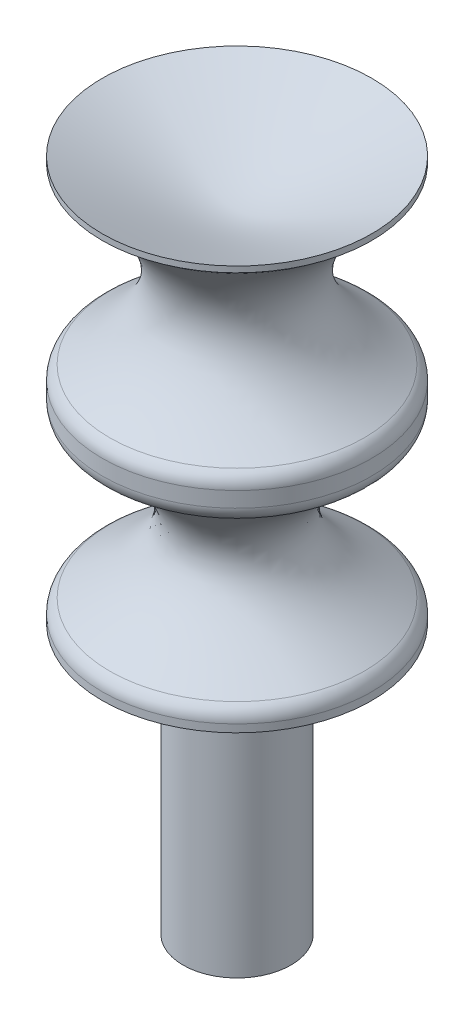
ISO-10303-21;
HEADER;
FILE_DESCRIPTION(('STEP AP214'),'2;1');
FILE_NAME('part.step','',(''),(''),'','','');
FILE_SCHEMA(('AUTOMOTIVE_DESIGN { 1 0 10303 214 1 1 1 1 }'));
ENDSEC;
DATA;
#1=APPLICATION_CONTEXT('core data for automotive mechanical design processes');
#2=APPLICATION_PROTOCOL_DEFINITION('international standard','automotive_design',2000,#1);
#3=PRODUCT_CONTEXT('',#1,'mechanical');
#4=PRODUCT('Part','Part','',(#3));
#5=PRODUCT_RELATED_PRODUCT_CATEGORY('part','',(#4));
#6=PRODUCT_DEFINITION_FORMATION('','',#4);
#7=PRODUCT_DEFINITION_CONTEXT('part definition',#1,'design');
#8=PRODUCT_DEFINITION('design','',#6,#7);
#9=PRODUCT_DEFINITION_SHAPE('','',#8);
#10=(LENGTH_UNIT() NAMED_UNIT(*) SI_UNIT(.MILLI.,.METRE.));
#11=(NAMED_UNIT(*) PLANE_ANGLE_UNIT() SI_UNIT($,.RADIAN.));
#12=(NAMED_UNIT(*) SI_UNIT($,.STERADIAN.) SOLID_ANGLE_UNIT());
#13=UNCERTAINTY_MEASURE_WITH_UNIT(LENGTH_MEASURE(1.E-05),#10,'distance_accuracy_value','');
#14=(GEOMETRIC_REPRESENTATION_CONTEXT(3) GLOBAL_UNCERTAINTY_ASSIGNED_CONTEXT((#13)) GLOBAL_UNIT_ASSIGNED_CONTEXT((#10,
#11,#12)) REPRESENTATION_CONTEXT('',''));
#15=CARTESIAN_POINT('',(0.,0.,0.));
#16=DIRECTION('',(0.,0.,1.));
#17=DIRECTION('',(1.,0.,0.));
#18=AXIS2_PLACEMENT_3D('',#15,#16,#17);
#19=CARTESIAN_POINT('',(0.,-9.525,0.));
#20=DIRECTION('',(0.,1.,0.));
#21=DIRECTION('',(0.,0.,1.));
#22=AXIS2_PLACEMENT_3D('',#19,#20,#21);
#23=CYLINDRICAL_SURFACE('',#22,6.35);
#24=CARTESIAN_POINT('',(0.,-9.16426613247415,0.));
#25=DIRECTION('',(0.,1.,0.));
#26=DIRECTION('',(0.,0.,1.));
#27=AXIS2_PLACEMENT_3D('',#24,#25,#26);
#28=CIRCLE('',#27,6.35);
#29=CARTESIAN_POINT('',(0.,-9.16426613247415,6.35));
#30=VERTEX_POINT('',#29);
#31=EDGE_CURVE('E84',#30,#30,#28,.T.);
#32=ORIENTED_EDGE('',*,*,#31,.F.);
#33=EDGE_LOOP('',(#32));
#34=FACE_BOUND('',#33,.T.);
#35=CARTESIAN_POINT('',(0.,-9.525,0.));
#36=DIRECTION('',(0.,1.,0.));
#37=DIRECTION('',(0.,0.,1.));
#38=AXIS2_PLACEMENT_3D('',#35,#36,#37);
#39=CIRCLE('',#38,6.35);
#40=CARTESIAN_POINT('',(0.,-9.525,6.35));
#41=VERTEX_POINT('',#40);
#42=EDGE_CURVE('E11',#41,#41,#39,.T.);
#43=ORIENTED_EDGE('',*,*,#42,.T.);
#44=EDGE_LOOP('',(#43));
#45=FACE_BOUND('',#44,.T.);
#46=ADVANCED_FACE('F32',(#34,#45),#23,.T.);
#47=CARTESIAN_POINT('',(0.,-9.525,-2.54));
#48=DIRECTION('',(0.,1.,0.));
#49=DIRECTION('',(0.,0.,1.));
#50=AXIS2_PLACEMENT_3D('',#47,#48,#49);
#51=PLANE('',#50);
#52=ORIENTED_EDGE('',*,*,#42,.F.);
#53=EDGE_LOOP('',(#52));
#54=FACE_BOUND('',#53,.T.);
#55=CARTESIAN_POINT('',(0.,-9.525,0.));
#56=DIRECTION('',(0.,1.,0.));
#57=DIRECTION('',(0.,0.,1.));
#58=AXIS2_PLACEMENT_3D('',#55,#56,#57);
#59=CIRCLE('',#58,2.54);
#60=CARTESIAN_POINT('',(0.,-9.525,2.54));
#61=VERTEX_POINT('',#60);
#62=EDGE_CURVE('E38',#61,#61,#59,.T.);
#63=ORIENTED_EDGE('',*,*,#62,.T.);
#64=EDGE_LOOP('',(#63));
#65=FACE_BOUND('',#64,.T.);
#66=ADVANCED_FACE('F63',(#54,#65),#51,.F.);
#67=CARTESIAN_POINT('',(0.,-9.525,0.));
#68=DIRECTION('',(0.,1.,0.));
#69=DIRECTION('',(0.,0.,1.));
#70=AXIS2_PLACEMENT_3D('',#67,#68,#69);
#71=CYLINDRICAL_SURFACE('',#70,2.54);
#72=ORIENTED_EDGE('',*,*,#62,.F.);
#73=EDGE_LOOP('',(#72));
#74=FACE_BOUND('',#73,.T.);
#75=CARTESIAN_POINT('',(0.,-22.225,0.));
#76=DIRECTION('',(0.,1.,0.));
#77=DIRECTION('',(0.,0.,1.));
#78=AXIS2_PLACEMENT_3D('',#75,#76,#77);
#79=CIRCLE('',#78,2.54);
#80=CARTESIAN_POINT('',(0.,-22.225,2.54));
#81=VERTEX_POINT('',#80);
#82=EDGE_CURVE('E51',#81,#81,#79,.T.);
#83=ORIENTED_EDGE('',*,*,#82,.T.);
#84=EDGE_LOOP('',(#83));
#85=FACE_BOUND('',#84,.T.);
#86=ADVANCED_FACE('F65',(#74,#85),#71,.T.);
#87=CARTESIAN_POINT('',(0.,-22.225,0.));
#88=DIRECTION('',(0.,1.,0.));
#89=DIRECTION('',(0.,0.,1.));
#90=AXIS2_PLACEMENT_3D('',#87,#88,#89);
#91=PLANE('',#90);
#92=ORIENTED_EDGE('',*,*,#82,.F.);
#93=EDGE_LOOP('',(#92));
#94=FACE_BOUND('',#93,.T.);
#95=ADVANCED_FACE('F45',(#94),#91,.F.);
#96=CARTESIAN_POINT('',(0.,9.52499999999999,-6.34999999999999));
#97=CARTESIAN_POINT('',(0.,7.39028757477112,-1.5875));
#98=CARTESIAN_POINT('',(0.,7.39028757477112,0.));
#99=(BOUNDED_CURVE() B_SPLINE_CURVE(2,(#96,#97,#98),.UNSPECIFIED.,.F.,
.F.) B_SPLINE_CURVE_WITH_KNOTS((3,3),(0.,1.),
.UNSPECIFIED.) CURVE() GEOMETRIC_REPRESENTATION_ITEM() RATIONAL_B_SPLINE_CURVE((1.,
1.4142135623731,1.)) REPRESENTATION_ITEM(''));
#100=CARTESIAN_POINT('',(0.,-9.525,0.));
#101=DIRECTION('',(0.,1.,0.));
#102=AXIS1_PLACEMENT('',#100,#101);
#103=SURFACE_OF_REVOLUTION('',#99,#102);
#104=CARTESIAN_POINT('',(0.,7.39028757477112,0.));
#105=VERTEX_POINT('',#104);
#106=VERTEX_LOOP('',#105);
#107=FACE_BOUND('',#106,.T.);
#108=CARTESIAN_POINT('',(0.,9.52499999999999,0.));
#109=DIRECTION('',(0.,1.,0.));
#110=DIRECTION('',(0.,0.,1.));
#111=AXIS2_PLACEMENT_3D('',#108,#109,#110);
#112=CIRCLE('',#111,6.35);
#113=CARTESIAN_POINT('',(0.,9.52499999999999,6.35));
#114=VERTEX_POINT('',#113);
#115=EDGE_CURVE('E49',#114,#114,#112,.T.);
#116=ORIENTED_EDGE('',*,*,#115,.T.);
#117=EDGE_LOOP('',(#116));
#118=FACE_BOUND('',#117,.T.);
#119=ADVANCED_FACE('F41',(#107,#118),#103,.T.);
#120=CARTESIAN_POINT('',(0.,-9.525,0.));
#121=DIRECTION('',(0.,1.,0.));
#122=DIRECTION('',(0.,0.,1.));
#123=AXIS2_PLACEMENT_3D('',#120,#121,#122);
#124=CYLINDRICAL_SURFACE('',#123,6.35);
#125=ORIENTED_EDGE('',*,*,#115,.F.);
#126=EDGE_LOOP('',(#125));
#127=FACE_BOUND('',#126,.T.);
#128=CARTESIAN_POINT('',(0.,9.2470516974163,0.));
#129=DIRECTION('',(0.,1.,0.));
#130=DIRECTION('',(0.,0.,1.));
#131=AXIS2_PLACEMENT_3D('',#128,#129,#130);
#132=CIRCLE('',#131,6.35);
#133=CARTESIAN_POINT('',(0.,9.2470516974163,6.35));
#134=VERTEX_POINT('',#133);
#135=EDGE_CURVE('E52',#134,#134,#132,.T.);
#136=ORIENTED_EDGE('',*,*,#135,.T.);
#137=EDGE_LOOP('',(#136));
#138=FACE_BOUND('',#137,.T.);
#139=ADVANCED_FACE('F44',(#127,#138),#124,.T.);
#140=CARTESIAN_POINT('',(0.,1.0219473740694,-5.99602155439972));
#141=CARTESIAN_POINT('',(0.,4.8911876439237,-0.18221811098451));
#142=CARTESIAN_POINT('',(0.,9.2470516974163,-6.34999999999999));
#143=B_SPLINE_CURVE_WITH_KNOTS('',2,(#140,#141,#142),.UNSPECIFIED.,.F.,.F.,(3,3),(0.,1.),.UNSPECIFIED.);
#144=CARTESIAN_POINT('',(0.,-9.525,0.));
#145=DIRECTION('',(0.,1.,0.));
#146=AXIS1_PLACEMENT('',#144,#145);
#147=SURFACE_OF_REVOLUTION('',#143,#146);
#148=ORIENTED_EDGE('',*,*,#135,.F.);
#149=EDGE_LOOP('',(#148));
#150=FACE_BOUND('',#149,.T.);
#151=CARTESIAN_POINT('',(0.,1.0219473740694,0.));
#152=DIRECTION('',(0.,1.,0.));
#153=DIRECTION('',(0.,0.,1.));
#154=AXIS2_PLACEMENT_3D('',#151,#152,#153);
#155=CIRCLE('',#154,5.99602155439972);
#156=CARTESIAN_POINT('',(0.,1.02194737406939,5.99602155439972));
#157=VERTEX_POINT('',#156);
#158=EDGE_CURVE('E57',#157,#157,#155,.T.);
#159=ORIENTED_EDGE('',*,*,#158,.T.);
#160=EDGE_LOOP('',(#159));
#161=FACE_BOUND('',#160,.T.);
#162=ADVANCED_FACE('F108',(#150,#161),#147,.T.);
#163=CARTESIAN_POINT('',(0.,0.361159932874533,0.));
#164=DIRECTION('',(0.,1.,0.));
#165=DIRECTION('',(0.,0.,1.));
#166=AXIS2_PLACEMENT_3D('',#163,#164,#165);
#167=TOROIDAL_SURFACE('',#166,5.55625,0.79375);
#168=ORIENTED_EDGE('',*,*,#158,.F.);
#169=EDGE_LOOP('',(#168));
#170=FACE_BOUND('',#169,.T.);
#171=CARTESIAN_POINT('',(0.,0.361159932874533,0.));
#172=DIRECTION('',(0.,1.,0.));
#173=DIRECTION('',(0.,0.,1.));
#174=AXIS2_PLACEMENT_3D('',#171,#172,#173);
#175=CIRCLE('',#174,6.35);
#176=CARTESIAN_POINT('',(0.,0.361159932874532,6.35));
#177=VERTEX_POINT('',#176);
#178=EDGE_CURVE('E103',#177,#177,#175,.T.);
#179=ORIENTED_EDGE('',*,*,#178,.T.);
#180=EDGE_LOOP('',(#179));
#181=FACE_BOUND('',#180,.T.);
#182=ADVANCED_FACE('F110',(#170,#181),#167,.T.);
#183=CARTESIAN_POINT('',(0.,-9.525,0.));
#184=DIRECTION('',(0.,1.,0.));
#185=DIRECTION('',(0.,0.,1.));
#186=AXIS2_PLACEMENT_3D('',#183,#184,#185);
#187=CYLINDRICAL_SURFACE('',#186,6.35);
#188=ORIENTED_EDGE('',*,*,#178,.F.);
#189=EDGE_LOOP('',(#188));
#190=FACE_BOUND('',#189,.T.);
#191=CARTESIAN_POINT('',(0.,-0.36073386752585,0.));
#192=DIRECTION('',(0.,1.,0.));
#193=DIRECTION('',(0.,0.,1.));
#194=AXIS2_PLACEMENT_3D('',#191,#192,#193);
#195=CIRCLE('',#194,6.35);
#196=CARTESIAN_POINT('',(0.,-0.360733867525851,6.35));
#197=VERTEX_POINT('',#196);
#198=EDGE_CURVE('E100',#197,#197,#195,.T.);
#199=ORIENTED_EDGE('',*,*,#198,.T.);
#200=EDGE_LOOP('',(#199));
#201=FACE_BOUND('',#200,.T.);
#202=ADVANCED_FACE('F113',(#190,#201),#187,.T.);
#203=CARTESIAN_POINT('',(0.,-0.36073386752585,0.));
#204=DIRECTION('',(0.,1.,0.));
#205=DIRECTION('',(0.,0.,1.));
#206=AXIS2_PLACEMENT_3D('',#203,#204,#205);
#207=TOROIDAL_SURFACE('',#206,5.55625,0.79375);
#208=ORIENTED_EDGE('',*,*,#198,.F.);
#209=EDGE_LOOP('',(#208));
#210=FACE_BOUND('',#209,.T.);
#211=CARTESIAN_POINT('',(0.,-1.02223631330636,0.));
#212=DIRECTION('',(0.,1.,0.));
#213=DIRECTION('',(0.,0.,1.));
#214=AXIS2_PLACEMENT_3D('',#211,#212,#213);
#215=CIRCLE('',#214,5.99494531194942);
#216=CARTESIAN_POINT('',(0.,-1.02223631330637,5.99494531194942));
#217=VERTEX_POINT('',#216);
#218=EDGE_CURVE('E90',#217,#217,#215,.T.);
#219=ORIENTED_EDGE('',*,*,#218,.T.);
#220=EDGE_LOOP('',(#219));
#221=FACE_BOUND('',#220,.T.);
#222=ADVANCED_FACE('F119',(#210,#221),#207,.T.);
#223=CARTESIAN_POINT('',(0.,-8.50276368669363,-5.99494531194941));
#224=CARTESIAN_POINT('',(0.,-6.63263184334682,-3.175));
#225=CARTESIAN_POINT('',(0.,-4.7625,-0.355054688050583));
#226=CARTESIAN_POINT('',(0.,-1.02223631330636,-5.99494531194941));
#227=B_SPLINE_CURVE_WITH_KNOTS('',3,(#223,#224,#225,#226),.UNSPECIFIED.,.F.,.F.,(4,4),(0.,1.),.UNSPECIFIED.);
#228=CARTESIAN_POINT('',(0.,-9.525,0.));
#229=DIRECTION('',(0.,1.,0.));
#230=AXIS1_PLACEMENT('',#228,#229);
#231=SURFACE_OF_REVOLUTION('',#227,#230);
#232=ORIENTED_EDGE('',*,*,#218,.F.);
#233=EDGE_LOOP('',(#232));
#234=FACE_BOUND('',#233,.T.);
#235=CARTESIAN_POINT('',(0.,-8.50276368669363,0.));
#236=DIRECTION('',(0.,1.,0.));
#237=DIRECTION('',(0.,0.,1.));
#238=AXIS2_PLACEMENT_3D('',#235,#236,#237);
#239=CIRCLE('',#238,5.99494531194941);
#240=CARTESIAN_POINT('',(0.,-8.50276368669363,5.99494531194942));
#241=VERTEX_POINT('',#240);
#242=EDGE_CURVE('E87',#241,#241,#239,.T.);
#243=ORIENTED_EDGE('',*,*,#242,.T.);
#244=EDGE_LOOP('',(#243));
#245=FACE_BOUND('',#244,.T.);
#246=ADVANCED_FACE('F125',(#234,#245),#231,.T.);
#247=CARTESIAN_POINT('',(0.,-9.16426613247415,0.));
#248=DIRECTION('',(0.,1.,0.));
#249=DIRECTION('',(0.,0.,1.));
#250=AXIS2_PLACEMENT_3D('',#247,#248,#249);
#251=TOROIDAL_SURFACE('',#250,5.55625,0.79375);
#252=ORIENTED_EDGE('',*,*,#242,.F.);
#253=EDGE_LOOP('',(#252));
#254=FACE_BOUND('',#253,.T.);
#255=ORIENTED_EDGE('',*,*,#31,.T.);
#256=EDGE_LOOP('',(#255));
#257=FACE_BOUND('',#256,.T.);
#258=ADVANCED_FACE('F131',(#254,#257),#251,.T.);
#259=CLOSED_SHELL('',(#46,#66,#86,#95,#119,#139,#162,#182,#202,#222,#246,#258));
#260=MANIFOLD_SOLID_BREP('B2',#259);
#261=ADVANCED_BREP_SHAPE_REPRESENTATION('',(#18,#260),#14);
#262=SHAPE_DEFINITION_REPRESENTATION(#9,#261);
ENDSEC;
END-ISO-10303-21;
